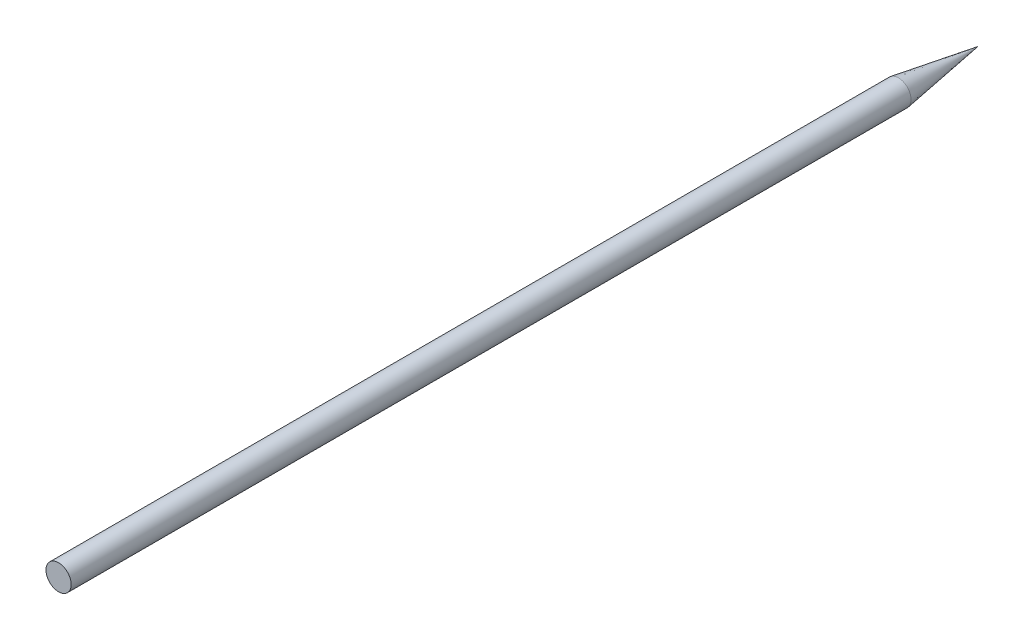
ISO-10303-21;
HEADER;
FILE_DESCRIPTION(('STEP AP214'),'2;1');
FILE_NAME('part.step','',(''),(''),'','','');
FILE_SCHEMA(('AUTOMOTIVE_DESIGN { 1 0 10303 214 1 1 1 1 }'));
ENDSEC;
DATA;
#1=APPLICATION_CONTEXT('core data for automotive mechanical design processes');
#2=APPLICATION_PROTOCOL_DEFINITION('international standard','automotive_design',2000,#1);
#3=PRODUCT_CONTEXT('',#1,'mechanical');
#4=PRODUCT('Part','Part','',(#3));
#5=PRODUCT_RELATED_PRODUCT_CATEGORY('part','',(#4));
#6=PRODUCT_DEFINITION_FORMATION('','',#4);
#7=PRODUCT_DEFINITION_CONTEXT('part definition',#1,'design');
#8=PRODUCT_DEFINITION('design','',#6,#7);
#9=PRODUCT_DEFINITION_SHAPE('','',#8);
#10=(LENGTH_UNIT() NAMED_UNIT(*) SI_UNIT(.MILLI.,.METRE.));
#11=(NAMED_UNIT(*) PLANE_ANGLE_UNIT() SI_UNIT($,.RADIAN.));
#12=(NAMED_UNIT(*) SI_UNIT($,.STERADIAN.) SOLID_ANGLE_UNIT());
#13=UNCERTAINTY_MEASURE_WITH_UNIT(LENGTH_MEASURE(1.E-05),#10,'distance_accuracy_value','');
#14=(GEOMETRIC_REPRESENTATION_CONTEXT(3) GLOBAL_UNCERTAINTY_ASSIGNED_CONTEXT((#13)) GLOBAL_UNIT_ASSIGNED_CONTEXT((#10,
#11,#12)) REPRESENTATION_CONTEXT('',''));
#15=CARTESIAN_POINT('',(0.,0.,0.));
#16=DIRECTION('',(0.,0.,1.));
#17=DIRECTION('',(1.,0.,0.));
#18=AXIS2_PLACEMENT_3D('',#15,#16,#17);
#19=CARTESIAN_POINT('',(0.,0.,100.));
#20=DIRECTION('',(0.,0.,-1.));
#21=DIRECTION('',(-1.,0.,0.));
#22=AXIS2_PLACEMENT_3D('',#19,#20,#21);
#23=CYLINDRICAL_SURFACE('',#22,1.5);
#24=CARTESIAN_POINT('',(0.,0.,100.));
#25=DIRECTION('',(0.,0.,1.));
#26=DIRECTION('',(1.,0.,0.));
#27=AXIS2_PLACEMENT_3D('',#24,#25,#26);
#28=CIRCLE('',#27,1.5);
#29=CARTESIAN_POINT('',(1.5,0.,100.));
#30=VERTEX_POINT('',#29);
#31=EDGE_CURVE('E11',#30,#30,#28,.T.);
#32=ORIENTED_EDGE('',*,*,#31,.F.);
#33=EDGE_LOOP('',(#32));
#34=FACE_BOUND('',#33,.T.);
#35=CARTESIAN_POINT('',(0.,0.,0.));
#36=DIRECTION('',(0.,0.,1.));
#37=DIRECTION('',(1.,0.,0.));
#38=AXIS2_PLACEMENT_3D('',#35,#36,#37);
#39=CIRCLE('',#38,1.5);
#40=CARTESIAN_POINT('',(1.5,0.,0.));
#41=VERTEX_POINT('',#40);
#42=EDGE_CURVE('E37',#41,#41,#39,.T.);
#43=ORIENTED_EDGE('',*,*,#42,.T.);
#44=EDGE_LOOP('',(#43));
#45=FACE_BOUND('',#44,.T.);
#46=ADVANCED_FACE('F31',(#34,#45),#23,.T.);
#47=CARTESIAN_POINT('',(0.,0.,100.));
#48=DIRECTION('',(0.,0.,1.));
#49=DIRECTION('',(1.,0.,0.));
#50=AXIS2_PLACEMENT_3D('',#47,#48,#49);
#51=PLANE('',#50);
#52=ORIENTED_EDGE('',*,*,#31,.T.);
#53=EDGE_LOOP('',(#52));
#54=FACE_BOUND('',#53,.T.);
#55=ADVANCED_FACE('F43',(#54),#51,.T.);
#56=CARTESIAN_POINT('',(0.,0.,0.));
#57=DIRECTION('',(0.,0.,1.));
#58=DIRECTION('',(1.,0.,0.));
#59=AXIS2_PLACEMENT_3D('',#56,#57,#58);
#60=CONICAL_SURFACE('',#59,1.5,0.15707963267949);
#61=CARTESIAN_POINT('',(0.,0.,-9.47062727201254));
#62=VERTEX_POINT('',#61);
#63=VERTEX_LOOP('',#62);
#64=FACE_BOUND('',#63,.T.);
#65=ORIENTED_EDGE('',*,*,#42,.F.);
#66=EDGE_LOOP('',(#65));
#67=FACE_BOUND('',#66,.T.);
#68=ADVANCED_FACE('F40',(#64,#67),#60,.T.);
#69=CLOSED_SHELL('',(#46,#55,#68));
#70=MANIFOLD_SOLID_BREP('B2',#69);
#71=ADVANCED_BREP_SHAPE_REPRESENTATION('',(#18,#70),#14);
#72=SHAPE_DEFINITION_REPRESENTATION(#9,#71);
ENDSEC;
END-ISO-10303-21;
